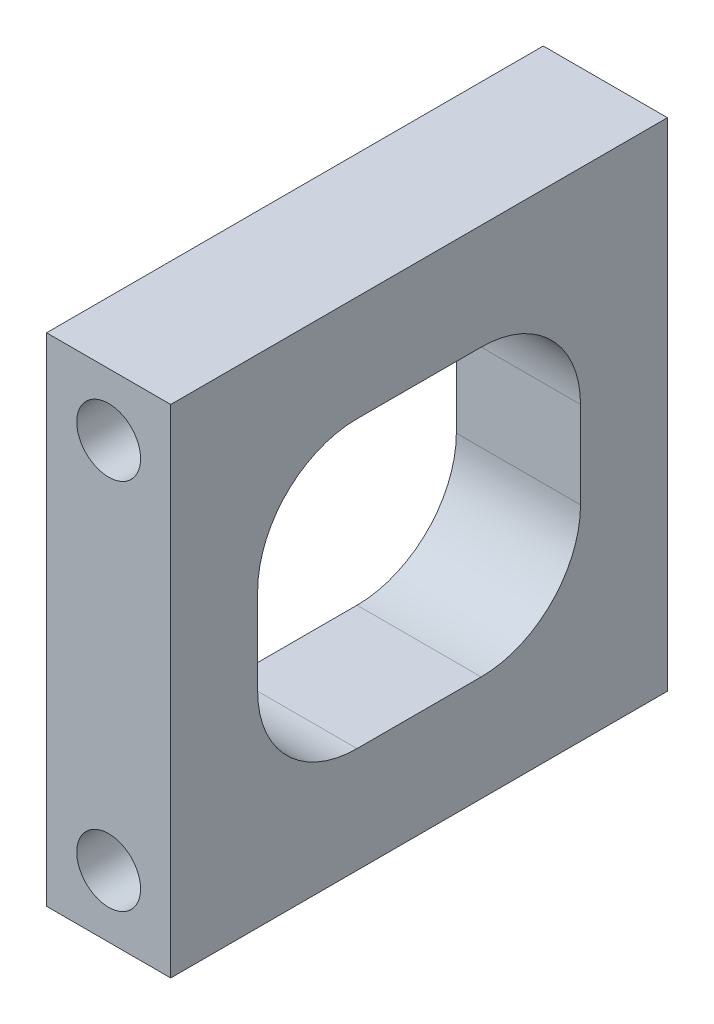
ISO-10303-21;
HEADER;
FILE_DESCRIPTION(('STEP AP214'),'2;1');
FILE_NAME('part.step','',(''),(''),'','','');
FILE_SCHEMA(('AUTOMOTIVE_DESIGN { 1 0 10303 214 1 1 1 1 }'));
ENDSEC;
DATA;
#1=APPLICATION_CONTEXT('core data for automotive mechanical design processes');
#2=APPLICATION_PROTOCOL_DEFINITION('international standard','automotive_design',2000,#1);
#3=PRODUCT_CONTEXT('',#1,'mechanical');
#4=PRODUCT('Part','Part','',(#3));
#5=PRODUCT_RELATED_PRODUCT_CATEGORY('part','',(#4));
#6=PRODUCT_DEFINITION_FORMATION('','',#4);
#7=PRODUCT_DEFINITION_CONTEXT('part definition',#1,'design');
#8=PRODUCT_DEFINITION('design','',#6,#7);
#9=PRODUCT_DEFINITION_SHAPE('','',#8);
#10=(LENGTH_UNIT() NAMED_UNIT(*) SI_UNIT(.MILLI.,.METRE.));
#11=(NAMED_UNIT(*) PLANE_ANGLE_UNIT() SI_UNIT($,.RADIAN.));
#12=(NAMED_UNIT(*) SI_UNIT($,.STERADIAN.) SOLID_ANGLE_UNIT());
#13=UNCERTAINTY_MEASURE_WITH_UNIT(LENGTH_MEASURE(1.E-05),#10,'distance_accuracy_value','');
#14=(GEOMETRIC_REPRESENTATION_CONTEXT(3) GLOBAL_UNCERTAINTY_ASSIGNED_CONTEXT((#13)) GLOBAL_UNIT_ASSIGNED_CONTEXT((#10,
#11,#12)) REPRESENTATION_CONTEXT('',''));
#15=CARTESIAN_POINT('',(0.,0.,0.));
#16=DIRECTION('',(0.,0.,1.));
#17=DIRECTION('',(1.,0.,0.));
#18=AXIS2_PLACEMENT_3D('',#15,#16,#17);
#19=CARTESIAN_POINT('',(0.,0.,50.8));
#20=DIRECTION('',(1.,0.,0.));
#21=DIRECTION('',(0.,0.,-1.));
#22=AXIS2_PLACEMENT_3D('',#19,#20,#21);
#23=PLANE('',#22);
#24=DIRECTION('',(0.,0.,1.));
#25=VECTOR('',#24,1.);
#26=CARTESIAN_POINT('',(0.,10.795,8.89));
#27=LINE('',#26,#25);
#28=CARTESIAN_POINT('',(0.,10.795,19.05));
#29=VERTEX_POINT('',#28);
#30=CARTESIAN_POINT('',(0.,10.795,31.75));
#31=VERTEX_POINT('',#30);
#32=EDGE_CURVE('E219',#29,#31,#27,.T.);
#33=ORIENTED_EDGE('',*,*,#32,.F.);
#34=CARTESIAN_POINT('',(0.,20.955,19.05));
#35=DIRECTION('',(1.,0.,0.));
#36=DIRECTION('',(0.,0.,-1.));
#37=AXIS2_PLACEMENT_3D('',#34,#35,#36);
#38=CIRCLE('',#37,10.16);
#39=CARTESIAN_POINT('',(0.,20.955,8.89));
#40=VERTEX_POINT('',#39);
#41=EDGE_CURVE('E179',#29,#40,#38,.T.);
#42=ORIENTED_EDGE('',*,*,#41,.T.);
#43=DIRECTION('',(0.,-1.,0.));
#44=VECTOR('',#43,1.);
#45=CARTESIAN_POINT('',(0.,40.005,8.89));
#46=LINE('',#45,#44);
#47=CARTESIAN_POINT('',(0.,29.845,8.89));
#48=VERTEX_POINT('',#47);
#49=EDGE_CURVE('E191',#48,#40,#46,.T.);
#50=ORIENTED_EDGE('',*,*,#49,.F.);
#51=CARTESIAN_POINT('',(0.,29.845,19.05));
#52=DIRECTION('',(1.,0.,0.));
#53=DIRECTION('',(0.,0.,-1.));
#54=AXIS2_PLACEMENT_3D('',#51,#52,#53);
#55=CIRCLE('',#54,10.16);
#56=CARTESIAN_POINT('',(0.,40.005,19.05));
#57=VERTEX_POINT('',#56);
#58=EDGE_CURVE('E45',#48,#57,#55,.T.);
#59=ORIENTED_EDGE('',*,*,#58,.T.);
#60=DIRECTION('',(0.,0.,-1.));
#61=VECTOR('',#60,1.);
#62=CARTESIAN_POINT('',(0.,40.005,8.89));
#63=LINE('',#62,#61);
#64=CARTESIAN_POINT('',(0.,40.005,31.75));
#65=VERTEX_POINT('',#64);
#66=EDGE_CURVE('E189',#65,#57,#63,.T.);
#67=ORIENTED_EDGE('',*,*,#66,.F.);
#68=CARTESIAN_POINT('',(0.,29.845,31.75));
#69=DIRECTION('',(1.,0.,0.));
#70=DIRECTION('',(0.,0.,-1.));
#71=AXIS2_PLACEMENT_3D('',#68,#69,#70);
#72=CIRCLE('',#71,10.16);
#73=CARTESIAN_POINT('',(0.,29.845,41.91));
#74=VERTEX_POINT('',#73);
#75=EDGE_CURVE('E183',#65,#74,#72,.T.);
#76=ORIENTED_EDGE('',*,*,#75,.T.);
#77=DIRECTION('',(0.,1.,0.));
#78=VECTOR('',#77,1.);
#79=CARTESIAN_POINT('',(0.,40.005,41.91));
#80=LINE('',#79,#78);
#81=CARTESIAN_POINT('',(0.,20.955,41.91));
#82=VERTEX_POINT('',#81);
#83=EDGE_CURVE('E197',#82,#74,#80,.T.);
#84=ORIENTED_EDGE('',*,*,#83,.F.);
#85=CARTESIAN_POINT('',(0.,20.955,31.75));
#86=DIRECTION('',(1.,0.,0.));
#87=DIRECTION('',(0.,0.,-1.));
#88=AXIS2_PLACEMENT_3D('',#85,#86,#87);
#89=CIRCLE('',#88,10.16);
#90=EDGE_CURVE('E175',#82,#31,#89,.T.);
#91=ORIENTED_EDGE('',*,*,#90,.T.);
#92=EDGE_LOOP('',(#33,#42,#50,#59,#67,#76,#84,#91));
#93=FACE_BOUND('',#92,.T.);
#94=DIRECTION('',(0.,-1.,0.));
#95=VECTOR('',#94,1.);
#96=CARTESIAN_POINT('',(0.,0.,0.));
#97=LINE('',#96,#95);
#98=CARTESIAN_POINT('',(0.,50.8,0.));
#99=VERTEX_POINT('',#98);
#100=CARTESIAN_POINT('',(0.,0.,0.));
#101=VERTEX_POINT('',#100);
#102=EDGE_CURVE('E150',#99,#101,#97,.T.);
#103=ORIENTED_EDGE('',*,*,#102,.T.);
#104=DIRECTION('',(0.,0.,-1.));
#105=VECTOR('',#104,1.);
#106=CARTESIAN_POINT('',(0.,0.,50.8));
#107=LINE('',#106,#105);
#108=CARTESIAN_POINT('',(0.,0.,50.8));
#109=VERTEX_POINT('',#108);
#110=EDGE_CURVE('E131',#109,#101,#107,.T.);
#111=ORIENTED_EDGE('',*,*,#110,.F.);
#112=DIRECTION('',(0.,-1.,0.));
#113=VECTOR('',#112,1.);
#114=CARTESIAN_POINT('',(0.,0.,50.8));
#115=LINE('',#114,#113);
#116=CARTESIAN_POINT('',(0.,50.8,50.8));
#117=VERTEX_POINT('',#116);
#118=EDGE_CURVE('E138',#117,#109,#115,.T.);
#119=ORIENTED_EDGE('',*,*,#118,.F.);
#120=DIRECTION('',(0.,0.,-1.));
#121=VECTOR('',#120,1.);
#122=CARTESIAN_POINT('',(0.,50.8,50.8));
#123=LINE('',#122,#121);
#124=EDGE_CURVE('E249',#117,#99,#123,.T.);
#125=ORIENTED_EDGE('',*,*,#124,.T.);
#126=EDGE_LOOP('',(#103,#111,#119,#125));
#127=FACE_BOUND('',#126,.T.);
#128=ADVANCED_FACE('F37',(#93,#127),#23,.F.);
#129=CARTESIAN_POINT('',(0.,0.,50.8));
#130=DIRECTION('',(0.,1.,0.));
#131=DIRECTION('',(0.,0.,1.));
#132=AXIS2_PLACEMENT_3D('',#129,#130,#131);
#133=PLANE('',#132);
#134=DIRECTION('',(1.,0.,0.));
#135=VECTOR('',#134,1.);
#136=CARTESIAN_POINT('',(0.,0.,0.));
#137=LINE('',#136,#135);
#138=CARTESIAN_POINT('',(12.7,0.,0.));
#139=VERTEX_POINT('',#138);
#140=EDGE_CURVE('E251',#101,#139,#137,.T.);
#141=ORIENTED_EDGE('',*,*,#140,.T.);
#142=DIRECTION('',(0.,0.,-1.));
#143=VECTOR('',#142,1.);
#144=CARTESIAN_POINT('',(12.7,0.,50.8));
#145=LINE('',#144,#143);
#146=CARTESIAN_POINT('',(12.7,0.,50.8));
#147=VERTEX_POINT('',#146);
#148=EDGE_CURVE('E134',#147,#139,#145,.T.);
#149=ORIENTED_EDGE('',*,*,#148,.F.);
#150=DIRECTION('',(1.,0.,0.));
#151=VECTOR('',#150,1.);
#152=CARTESIAN_POINT('',(0.,0.,50.8));
#153=LINE('',#152,#151);
#154=EDGE_CURVE('E127',#109,#147,#153,.T.);
#155=ORIENTED_EDGE('',*,*,#154,.F.);
#156=ORIENTED_EDGE('',*,*,#110,.T.);
#157=EDGE_LOOP('',(#141,#149,#155,#156));
#158=FACE_BOUND('',#157,.T.);
#159=ADVANCED_FACE('F129',(#158),#133,.F.);
#160=CARTESIAN_POINT('',(12.7,0.,50.8));
#161=DIRECTION('',(-1.,0.,0.));
#162=DIRECTION('',(0.,0.,1.));
#163=AXIS2_PLACEMENT_3D('',#160,#161,#162);
#164=PLANE('',#163);
#165=DIRECTION('',(0.,1.,0.));
#166=VECTOR('',#165,1.);
#167=CARTESIAN_POINT('',(12.7,40.005,41.91));
#168=LINE('',#167,#166);
#169=CARTESIAN_POINT('',(12.7,20.955,41.91));
#170=VERTEX_POINT('',#169);
#171=CARTESIAN_POINT('',(12.7,29.845,41.91));
#172=VERTEX_POINT('',#171);
#173=EDGE_CURVE('E212',#170,#172,#168,.T.);
#174=ORIENTED_EDGE('',*,*,#173,.T.);
#175=CARTESIAN_POINT('',(12.7,29.845,31.75));
#176=DIRECTION('',(-1.,0.,0.));
#177=DIRECTION('',(0.,0.,1.));
#178=AXIS2_PLACEMENT_3D('',#175,#176,#177);
#179=CIRCLE('',#178,10.16);
#180=CARTESIAN_POINT('',(12.7,40.005,31.75));
#181=VERTEX_POINT('',#180);
#182=EDGE_CURVE('E59',#172,#181,#179,.T.);
#183=ORIENTED_EDGE('',*,*,#182,.T.);
#184=DIRECTION('',(0.,0.,-1.));
#185=VECTOR('',#184,1.);
#186=CARTESIAN_POINT('',(12.7,40.005,8.89));
#187=LINE('',#186,#185);
#188=CARTESIAN_POINT('',(12.7,40.005,19.05));
#189=VERTEX_POINT('',#188);
#190=EDGE_CURVE('E205',#181,#189,#187,.T.);
#191=ORIENTED_EDGE('',*,*,#190,.T.);
#192=CARTESIAN_POINT('',(12.7,29.845,19.05));
#193=DIRECTION('',(-1.,0.,0.));
#194=DIRECTION('',(0.,0.,1.));
#195=AXIS2_PLACEMENT_3D('',#192,#193,#194);
#196=CIRCLE('',#195,10.16);
#197=CARTESIAN_POINT('',(12.7,29.845,8.89));
#198=VERTEX_POINT('',#197);
#199=EDGE_CURVE('E11',#189,#198,#196,.T.);
#200=ORIENTED_EDGE('',*,*,#199,.T.);
#201=DIRECTION('',(0.,-1.,0.));
#202=VECTOR('',#201,1.);
#203=CARTESIAN_POINT('',(12.7,40.005,8.89));
#204=LINE('',#203,#202);
#205=CARTESIAN_POINT('',(12.7,20.955,8.89));
#206=VERTEX_POINT('',#205);
#207=EDGE_CURVE('E196',#198,#206,#204,.T.);
#208=ORIENTED_EDGE('',*,*,#207,.T.);
#209=CARTESIAN_POINT('',(12.7,20.955,19.05));
#210=DIRECTION('',(-1.,0.,0.));
#211=DIRECTION('',(0.,0.,1.));
#212=AXIS2_PLACEMENT_3D('',#209,#210,#211);
#213=CIRCLE('',#212,10.16);
#214=CARTESIAN_POINT('',(12.7,10.795,19.05));
#215=VERTEX_POINT('',#214);
#216=EDGE_CURVE('E181',#206,#215,#213,.T.);
#217=ORIENTED_EDGE('',*,*,#216,.T.);
#218=DIRECTION('',(0.,0.,1.));
#219=VECTOR('',#218,1.);
#220=CARTESIAN_POINT('',(12.7,10.795,8.89));
#221=LINE('',#220,#219);
#222=CARTESIAN_POINT('',(12.7,10.795,31.75));
#223=VERTEX_POINT('',#222);
#224=EDGE_CURVE('E209',#215,#223,#221,.T.);
#225=ORIENTED_EDGE('',*,*,#224,.T.);
#226=CARTESIAN_POINT('',(12.7,20.955,31.75));
#227=DIRECTION('',(-1.,0.,0.));
#228=DIRECTION('',(0.,0.,1.));
#229=AXIS2_PLACEMENT_3D('',#226,#227,#228);
#230=CIRCLE('',#229,10.16);
#231=EDGE_CURVE('E177',#223,#170,#230,.T.);
#232=ORIENTED_EDGE('',*,*,#231,.T.);
#233=EDGE_LOOP('',(#174,#183,#191,#200,#208,#217,#225,#232));
#234=FACE_BOUND('',#233,.T.);
#235=DIRECTION('',(0.,1.,0.));
#236=VECTOR('',#235,1.);
#237=CARTESIAN_POINT('',(12.7,0.,0.));
#238=LINE('',#237,#236);
#239=CARTESIAN_POINT('',(12.7,50.8,0.));
#240=VERTEX_POINT('',#239);
#241=EDGE_CURVE('E253',#139,#240,#238,.T.);
#242=ORIENTED_EDGE('',*,*,#241,.T.);
#243=DIRECTION('',(0.,0.,-1.));
#244=VECTOR('',#243,1.);
#245=CARTESIAN_POINT('',(12.7,50.8,50.8));
#246=LINE('',#245,#244);
#247=CARTESIAN_POINT('',(12.7,50.8,50.8));
#248=VERTEX_POINT('',#247);
#249=EDGE_CURVE('E155',#248,#240,#246,.T.);
#250=ORIENTED_EDGE('',*,*,#249,.F.);
#251=DIRECTION('',(0.,1.,0.));
#252=VECTOR('',#251,1.);
#253=CARTESIAN_POINT('',(12.7,0.,50.8));
#254=LINE('',#253,#252);
#255=EDGE_CURVE('E137',#147,#248,#254,.T.);
#256=ORIENTED_EDGE('',*,*,#255,.F.);
#257=ORIENTED_EDGE('',*,*,#148,.T.);
#258=EDGE_LOOP('',(#242,#250,#256,#257));
#259=FACE_BOUND('',#258,.T.);
#260=ADVANCED_FACE('F202',(#234,#259),#164,.F.);
#261=CARTESIAN_POINT('',(0.,50.8,50.8));
#262=DIRECTION('',(0.,-1.,0.));
#263=DIRECTION('',(0.,0.,-1.));
#264=AXIS2_PLACEMENT_3D('',#261,#262,#263);
#265=PLANE('',#264);
#266=DIRECTION('',(-1.,0.,0.));
#267=VECTOR('',#266,1.);
#268=CARTESIAN_POINT('',(0.,50.8,0.));
#269=LINE('',#268,#267);
#270=EDGE_CURVE('E147',#240,#99,#269,.T.);
#271=ORIENTED_EDGE('',*,*,#270,.T.);
#272=ORIENTED_EDGE('',*,*,#124,.F.);
#273=DIRECTION('',(-1.,0.,0.));
#274=VECTOR('',#273,1.);
#275=CARTESIAN_POINT('',(0.,50.8,50.8));
#276=LINE('',#275,#274);
#277=EDGE_CURVE('E143',#248,#117,#276,.T.);
#278=ORIENTED_EDGE('',*,*,#277,.F.);
#279=ORIENTED_EDGE('',*,*,#249,.T.);
#280=EDGE_LOOP('',(#271,#272,#278,#279));
#281=FACE_BOUND('',#280,.T.);
#282=ADVANCED_FACE('F260',(#281),#265,.F.);
#283=CARTESIAN_POINT('',(0.,0.,50.8));
#284=DIRECTION('',(0.,0.,-1.));
#285=DIRECTION('',(-1.,0.,0.));
#286=AXIS2_PLACEMENT_3D('',#283,#284,#285);
#287=PLANE('',#286);
#288=CARTESIAN_POINT('',(6.35,44.45,50.8));
#289=DIRECTION('',(0.,0.,1.));
#290=DIRECTION('',(1.,0.,0.));
#291=AXIS2_PLACEMENT_3D('',#288,#289,#290);
#292=CIRCLE('',#291,3.2639);
#293=CARTESIAN_POINT('',(9.6139,44.45,50.8));
#294=VERTEX_POINT('',#293);
#295=EDGE_CURVE('E239',#294,#294,#292,.T.);
#296=ORIENTED_EDGE('',*,*,#295,.F.);
#297=EDGE_LOOP('',(#296));
#298=FACE_BOUND('',#297,.T.);
#299=CARTESIAN_POINT('',(6.35,6.35,50.8));
#300=DIRECTION('',(0.,0.,1.));
#301=DIRECTION('',(1.,0.,0.));
#302=AXIS2_PLACEMENT_3D('',#299,#300,#301);
#303=CIRCLE('',#302,3.2639);
#304=CARTESIAN_POINT('',(9.6139,6.35,50.8));
#305=VERTEX_POINT('',#304);
#306=EDGE_CURVE('E242',#305,#305,#303,.T.);
#307=ORIENTED_EDGE('',*,*,#306,.F.);
#308=EDGE_LOOP('',(#307));
#309=FACE_BOUND('',#308,.T.);
#310=ORIENTED_EDGE('',*,*,#118,.T.);
#311=ORIENTED_EDGE('',*,*,#154,.T.);
#312=ORIENTED_EDGE('',*,*,#255,.T.);
#313=ORIENTED_EDGE('',*,*,#277,.T.);
#314=EDGE_LOOP('',(#310,#311,#312,#313));
#315=FACE_BOUND('',#314,.T.);
#316=ADVANCED_FACE('F141',(#298,#309,#315),#287,.F.);
#317=CARTESIAN_POINT('',(0.,0.,0.));
#318=DIRECTION('',(0.,0.,-1.));
#319=DIRECTION('',(-1.,0.,0.));
#320=AXIS2_PLACEMENT_3D('',#317,#318,#319);
#321=PLANE('',#320);
#322=CARTESIAN_POINT('',(6.35,44.45,0.));
#323=DIRECTION('',(0.,0.,1.));
#324=DIRECTION('',(1.,0.,0.));
#325=AXIS2_PLACEMENT_3D('',#322,#323,#324);
#326=CIRCLE('',#325,3.2639);
#327=CARTESIAN_POINT('',(9.6139,44.45,0.));
#328=VERTEX_POINT('',#327);
#329=EDGE_CURVE('E228',#328,#328,#326,.T.);
#330=ORIENTED_EDGE('',*,*,#329,.T.);
#331=EDGE_LOOP('',(#330));
#332=FACE_BOUND('',#331,.T.);
#333=CARTESIAN_POINT('',(6.35,6.35,0.));
#334=DIRECTION('',(0.,0.,1.));
#335=DIRECTION('',(1.,0.,0.));
#336=AXIS2_PLACEMENT_3D('',#333,#334,#335);
#337=CIRCLE('',#336,3.2639);
#338=CARTESIAN_POINT('',(9.6139,6.35,0.));
#339=VERTEX_POINT('',#338);
#340=EDGE_CURVE('E217',#339,#339,#337,.T.);
#341=ORIENTED_EDGE('',*,*,#340,.T.);
#342=EDGE_LOOP('',(#341));
#343=FACE_BOUND('',#342,.T.);
#344=ORIENTED_EDGE('',*,*,#102,.F.);
#345=ORIENTED_EDGE('',*,*,#270,.F.);
#346=ORIENTED_EDGE('',*,*,#241,.F.);
#347=ORIENTED_EDGE('',*,*,#140,.F.);
#348=EDGE_LOOP('',(#344,#345,#346,#347));
#349=FACE_BOUND('',#348,.T.);
#350=ADVANCED_FACE('F263',(#332,#343,#349),#321,.T.);
#351=CARTESIAN_POINT('',(6.35,6.35,31.75));
#352=DIRECTION('',(0.,0.,1.));
#353=DIRECTION('',(1.,0.,0.));
#354=AXIS2_PLACEMENT_3D('',#351,#352,#353);
#355=CYLINDRICAL_SURFACE('',#354,3.2639);
#356=CARTESIAN_POINT('',(6.35,6.35,31.75));
#357=DIRECTION('',(0.,0.,1.));
#358=DIRECTION('',(1.,0.,0.));
#359=AXIS2_PLACEMENT_3D('',#356,#357,#358);
#360=CIRCLE('',#359,3.2639);
#361=CARTESIAN_POINT('',(9.6139,6.35,31.75));
#362=VERTEX_POINT('',#361);
#363=EDGE_CURVE('E227',#362,#362,#360,.T.);
#364=ORIENTED_EDGE('',*,*,#363,.F.);
#365=EDGE_LOOP('',(#364));
#366=FACE_BOUND('',#365,.T.);
#367=ORIENTED_EDGE('',*,*,#306,.T.);
#368=EDGE_LOOP('',(#367));
#369=FACE_BOUND('',#368,.T.);
#370=ADVANCED_FACE('F337',(#366,#369),#355,.F.);
#371=CARTESIAN_POINT('',(6.35,6.35,31.75));
#372=DIRECTION('',(0.,0.,1.));
#373=DIRECTION('',(1.,0.,0.));
#374=AXIS2_PLACEMENT_3D('',#371,#372,#373);
#375=PLANE('',#374);
#376=ORIENTED_EDGE('',*,*,#363,.T.);
#377=EDGE_LOOP('',(#376));
#378=FACE_BOUND('',#377,.T.);
#379=ADVANCED_FACE('F335',(#378),#375,.T.);
#380=CARTESIAN_POINT('',(6.35,44.45,31.75));
#381=DIRECTION('',(0.,0.,1.));
#382=DIRECTION('',(1.,0.,0.));
#383=AXIS2_PLACEMENT_3D('',#380,#381,#382);
#384=CYLINDRICAL_SURFACE('',#383,3.2639);
#385=CARTESIAN_POINT('',(6.35,44.45,31.75));
#386=DIRECTION('',(0.,0.,1.));
#387=DIRECTION('',(1.,0.,0.));
#388=AXIS2_PLACEMENT_3D('',#385,#386,#387);
#389=CIRCLE('',#388,3.2639);
#390=CARTESIAN_POINT('',(9.6139,44.45,31.75));
#391=VERTEX_POINT('',#390);
#392=EDGE_CURVE('E236',#391,#391,#389,.T.);
#393=ORIENTED_EDGE('',*,*,#392,.F.);
#394=EDGE_LOOP('',(#393));
#395=FACE_BOUND('',#394,.T.);
#396=ORIENTED_EDGE('',*,*,#295,.T.);
#397=EDGE_LOOP('',(#396));
#398=FACE_BOUND('',#397,.T.);
#399=ADVANCED_FACE('F331',(#395,#398),#384,.F.);
#400=CARTESIAN_POINT('',(6.35,44.45,31.75));
#401=DIRECTION('',(0.,0.,1.));
#402=DIRECTION('',(1.,0.,0.));
#403=AXIS2_PLACEMENT_3D('',#400,#401,#402);
#404=PLANE('',#403);
#405=ORIENTED_EDGE('',*,*,#392,.T.);
#406=EDGE_LOOP('',(#405));
#407=FACE_BOUND('',#406,.T.);
#408=ADVANCED_FACE('F327',(#407),#404,.T.);
#409=CARTESIAN_POINT('',(6.35,6.35,19.05));
#410=DIRECTION('',(0.,0.,-1.));
#411=DIRECTION('',(-1.,0.,0.));
#412=AXIS2_PLACEMENT_3D('',#409,#410,#411);
#413=CYLINDRICAL_SURFACE('',#412,3.2639);
#414=CARTESIAN_POINT('',(6.35,6.35,19.05));
#415=DIRECTION('',(0.,0.,1.));
#416=DIRECTION('',(1.,0.,0.));
#417=AXIS2_PLACEMENT_3D('',#414,#415,#416);
#418=CIRCLE('',#417,3.2639);
#419=CARTESIAN_POINT('',(9.6139,6.35,19.05));
#420=VERTEX_POINT('',#419);
#421=EDGE_CURVE('E231',#420,#420,#418,.T.);
#422=ORIENTED_EDGE('',*,*,#421,.T.);
#423=EDGE_LOOP('',(#422));
#424=FACE_BOUND('',#423,.T.);
#425=ORIENTED_EDGE('',*,*,#340,.F.);
#426=EDGE_LOOP('',(#425));
#427=FACE_BOUND('',#426,.T.);
#428=ADVANCED_FACE('F323',(#424,#427),#413,.F.);
#429=CARTESIAN_POINT('',(6.35,6.35,19.05));
#430=DIRECTION('',(0.,0.,-1.));
#431=DIRECTION('',(1.,0.,0.));
#432=AXIS2_PLACEMENT_3D('',#429,#430,#431);
#433=PLANE('',#432);
#434=ORIENTED_EDGE('',*,*,#421,.F.);
#435=EDGE_LOOP('',(#434));
#436=FACE_BOUND('',#435,.T.);
#437=ADVANCED_FACE('F319',(#436),#433,.T.);
#438=CARTESIAN_POINT('',(6.35,44.45,19.05));
#439=DIRECTION('',(0.,0.,-1.));
#440=DIRECTION('',(-1.,0.,0.));
#441=AXIS2_PLACEMENT_3D('',#438,#439,#440);
#442=CYLINDRICAL_SURFACE('',#441,3.2639);
#443=CARTESIAN_POINT('',(6.35,44.45,19.05));
#444=DIRECTION('',(0.,0.,1.));
#445=DIRECTION('',(1.,0.,0.));
#446=AXIS2_PLACEMENT_3D('',#443,#444,#445);
#447=CIRCLE('',#446,3.2639);
#448=CARTESIAN_POINT('',(9.6139,44.45,19.05));
#449=VERTEX_POINT('',#448);
#450=EDGE_CURVE('E224',#449,#449,#447,.T.);
#451=ORIENTED_EDGE('',*,*,#450,.T.);
#452=EDGE_LOOP('',(#451));
#453=FACE_BOUND('',#452,.T.);
#454=ORIENTED_EDGE('',*,*,#329,.F.);
#455=EDGE_LOOP('',(#454));
#456=FACE_BOUND('',#455,.T.);
#457=ADVANCED_FACE('F315',(#453,#456),#442,.F.);
#458=CARTESIAN_POINT('',(6.35,44.45,19.05));
#459=DIRECTION('',(0.,0.,-1.));
#460=DIRECTION('',(1.,0.,0.));
#461=AXIS2_PLACEMENT_3D('',#458,#459,#460);
#462=PLANE('',#461);
#463=ORIENTED_EDGE('',*,*,#450,.F.);
#464=EDGE_LOOP('',(#463));
#465=FACE_BOUND('',#464,.T.);
#466=ADVANCED_FACE('F312',(#465),#462,.T.);
#467=CARTESIAN_POINT('',(12.7,40.005,8.89));
#468=DIRECTION('',(0.,0.,-1.));
#469=DIRECTION('',(0.,1.,0.));
#470=AXIS2_PLACEMENT_3D('',#467,#468,#469);
#471=PLANE('',#470);
#472=ORIENTED_EDGE('',*,*,#49,.T.);
#473=DIRECTION('',(-1.,0.,0.));
#474=VECTOR('',#473,1.);
#475=CARTESIAN_POINT('',(12.7,20.955,8.89));
#476=LINE('',#475,#474);
#477=EDGE_CURVE('E169',#40,#206,#476,.F.);
#478=ORIENTED_EDGE('',*,*,#477,.T.);
#479=ORIENTED_EDGE('',*,*,#207,.F.);
#480=DIRECTION('',(-1.,0.,0.));
#481=VECTOR('',#480,1.);
#482=CARTESIAN_POINT('',(0.,29.845,8.89));
#483=LINE('',#482,#481);
#484=EDGE_CURVE('E166',#198,#48,#483,.T.);
#485=ORIENTED_EDGE('',*,*,#484,.T.);
#486=EDGE_LOOP('',(#472,#478,#479,#485));
#487=FACE_BOUND('',#486,.T.);
#488=ADVANCED_FACE('F207',(#487),#471,.F.);
#489=CARTESIAN_POINT('',(12.7,40.005,8.89));
#490=DIRECTION('',(0.,1.,0.));
#491=DIRECTION('',(0.,0.,1.));
#492=AXIS2_PLACEMENT_3D('',#489,#490,#491);
#493=PLANE('',#492);
#494=ORIENTED_EDGE('',*,*,#190,.F.);
#495=DIRECTION('',(-1.,0.,0.));
#496=VECTOR('',#495,1.);
#497=CARTESIAN_POINT('',(0.,40.005,31.75));
#498=LINE('',#497,#496);
#499=EDGE_CURVE('E172',#181,#65,#498,.T.);
#500=ORIENTED_EDGE('',*,*,#499,.T.);
#501=ORIENTED_EDGE('',*,*,#66,.T.);
#502=DIRECTION('',(-1.,0.,0.));
#503=VECTOR('',#502,1.);
#504=CARTESIAN_POINT('',(12.7,40.005,19.05));
#505=LINE('',#504,#503);
#506=EDGE_CURVE('E52',#57,#189,#505,.F.);
#507=ORIENTED_EDGE('',*,*,#506,.T.);
#508=EDGE_LOOP('',(#494,#500,#501,#507));
#509=FACE_BOUND('',#508,.T.);
#510=ADVANCED_FACE('F194',(#509),#493,.F.);
#511=CARTESIAN_POINT('',(12.7,40.005,41.91));
#512=DIRECTION('',(0.,0.,1.));
#513=DIRECTION('',(1.,0.,0.));
#514=AXIS2_PLACEMENT_3D('',#511,#512,#513);
#515=PLANE('',#514);
#516=ORIENTED_EDGE('',*,*,#173,.F.);
#517=DIRECTION('',(-1.,0.,0.));
#518=VECTOR('',#517,1.);
#519=CARTESIAN_POINT('',(0.,20.955,41.91));
#520=LINE('',#519,#518);
#521=EDGE_CURVE('E153',#170,#82,#520,.T.);
#522=ORIENTED_EDGE('',*,*,#521,.T.);
#523=ORIENTED_EDGE('',*,*,#83,.T.);
#524=DIRECTION('',(-1.,0.,0.));
#525=VECTOR('',#524,1.);
#526=CARTESIAN_POINT('',(12.7,29.845,41.91));
#527=LINE('',#526,#525);
#528=EDGE_CURVE('E151',#74,#172,#527,.F.);
#529=ORIENTED_EDGE('',*,*,#528,.T.);
#530=EDGE_LOOP('',(#516,#522,#523,#529));
#531=FACE_BOUND('',#530,.T.);
#532=ADVANCED_FACE('F295',(#531),#515,.F.);
#533=CARTESIAN_POINT('',(12.7,10.795,8.89));
#534=DIRECTION('',(0.,-1.,0.));
#535=DIRECTION('',(0.,0.,-1.));
#536=AXIS2_PLACEMENT_3D('',#533,#534,#535);
#537=PLANE('',#536);
#538=ORIENTED_EDGE('',*,*,#32,.T.);
#539=DIRECTION('',(-1.,0.,0.));
#540=VECTOR('',#539,1.);
#541=CARTESIAN_POINT('',(12.7,10.795,31.75));
#542=LINE('',#541,#540);
#543=EDGE_CURVE('E164',#31,#223,#542,.F.);
#544=ORIENTED_EDGE('',*,*,#543,.T.);
#545=ORIENTED_EDGE('',*,*,#224,.F.);
#546=DIRECTION('',(-1.,0.,0.));
#547=VECTOR('',#546,1.);
#548=CARTESIAN_POINT('',(0.,10.795,19.05));
#549=LINE('',#548,#547);
#550=EDGE_CURVE('E161',#215,#29,#549,.T.);
#551=ORIENTED_EDGE('',*,*,#550,.T.);
#552=EDGE_LOOP('',(#538,#544,#545,#551));
#553=FACE_BOUND('',#552,.T.);
#554=ADVANCED_FACE('F281',(#553),#537,.F.);
#555=CARTESIAN_POINT('',(12.7,20.955,31.75));
#556=DIRECTION('',(1.,0.,0.));
#557=DIRECTION('',(0.,0.,-1.));
#558=AXIS2_PLACEMENT_3D('',#555,#556,#557);
#559=CYLINDRICAL_SURFACE('',#558,10.16);
#560=ORIENTED_EDGE('',*,*,#231,.F.);
#561=ORIENTED_EDGE('',*,*,#543,.F.);
#562=ORIENTED_EDGE('',*,*,#90,.F.);
#563=ORIENTED_EDGE('',*,*,#521,.F.);
#564=EDGE_LOOP('',(#560,#561,#562,#563));
#565=FACE_BOUND('',#564,.T.);
#566=ADVANCED_FACE('F277',(#565),#559,.F.);
#567=CARTESIAN_POINT('',(12.7,20.955,19.05));
#568=DIRECTION('',(1.,0.,0.));
#569=DIRECTION('',(0.,0.,-1.));
#570=AXIS2_PLACEMENT_3D('',#567,#568,#569);
#571=CYLINDRICAL_SURFACE('',#570,10.16);
#572=ORIENTED_EDGE('',*,*,#216,.F.);
#573=ORIENTED_EDGE('',*,*,#477,.F.);
#574=ORIENTED_EDGE('',*,*,#41,.F.);
#575=ORIENTED_EDGE('',*,*,#550,.F.);
#576=EDGE_LOOP('',(#572,#573,#574,#575));
#577=FACE_BOUND('',#576,.T.);
#578=ADVANCED_FACE('F280',(#577),#571,.F.);
#579=CARTESIAN_POINT('',(12.7,29.845,31.75));
#580=DIRECTION('',(1.,0.,0.));
#581=DIRECTION('',(0.,0.,-1.));
#582=AXIS2_PLACEMENT_3D('',#579,#580,#581);
#583=CYLINDRICAL_SURFACE('',#582,10.16);
#584=ORIENTED_EDGE('',*,*,#182,.F.);
#585=ORIENTED_EDGE('',*,*,#528,.F.);
#586=ORIENTED_EDGE('',*,*,#75,.F.);
#587=ORIENTED_EDGE('',*,*,#499,.F.);
#588=EDGE_LOOP('',(#584,#585,#586,#587));
#589=FACE_BOUND('',#588,.T.);
#590=ADVANCED_FACE('F284',(#589),#583,.F.);
#591=CARTESIAN_POINT('',(12.7,29.845,19.05));
#592=DIRECTION('',(1.,0.,0.));
#593=DIRECTION('',(0.,0.,-1.));
#594=AXIS2_PLACEMENT_3D('',#591,#592,#593);
#595=CYLINDRICAL_SURFACE('',#594,10.16);
#596=ORIENTED_EDGE('',*,*,#199,.F.);
#597=ORIENTED_EDGE('',*,*,#506,.F.);
#598=ORIENTED_EDGE('',*,*,#58,.F.);
#599=ORIENTED_EDGE('',*,*,#484,.F.);
#600=EDGE_LOOP('',(#596,#597,#598,#599));
#601=FACE_BOUND('',#600,.T.);
#602=ADVANCED_FACE('F39',(#601),#595,.F.);
#603=CLOSED_SHELL('',(#128,#159,#260,#282,#316,#350,#370,#379,#399,#408,#428,#437,#457,#466,
#488,#510,#532,#554,#566,#578,#590,#602));
#604=MANIFOLD_SOLID_BREP('B2',#603);
#605=ADVANCED_BREP_SHAPE_REPRESENTATION('',(#18,#604),#14);
#606=SHAPE_DEFINITION_REPRESENTATION(#9,#605);
ENDSEC;
END-ISO-10303-21;
